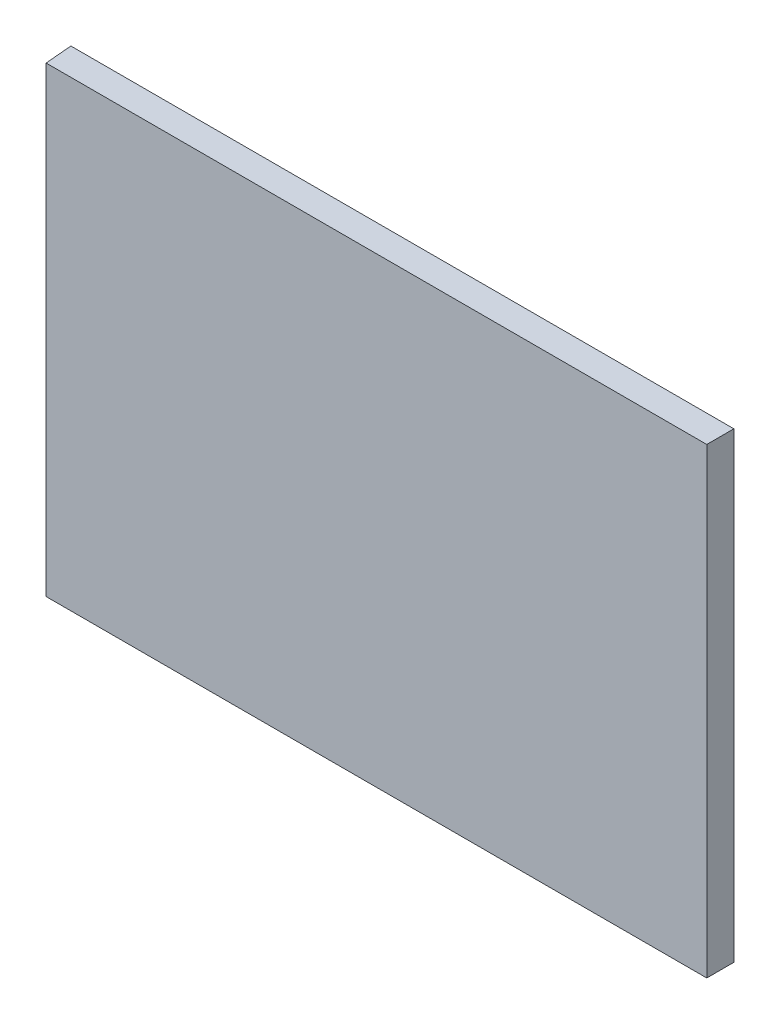
ISO-10303-21;
HEADER;
FILE_DESCRIPTION(('STEP AP214'),'2;1');
FILE_NAME('part.step','',(''),(''),'','','');
FILE_SCHEMA(('AUTOMOTIVE_DESIGN { 1 0 10303 214 1 1 1 1 }'));
ENDSEC;
DATA;
#1=APPLICATION_CONTEXT('core data for automotive mechanical design processes');
#2=APPLICATION_PROTOCOL_DEFINITION('international standard','automotive_design',2000,#1);
#3=PRODUCT_CONTEXT('',#1,'mechanical');
#4=PRODUCT('Part','Part','',(#3));
#5=PRODUCT_RELATED_PRODUCT_CATEGORY('part','',(#4));
#6=PRODUCT_DEFINITION_FORMATION('','',#4);
#7=PRODUCT_DEFINITION_CONTEXT('part definition',#1,'design');
#8=PRODUCT_DEFINITION('design','',#6,#7);
#9=PRODUCT_DEFINITION_SHAPE('','',#8);
#10=(LENGTH_UNIT() NAMED_UNIT(*) SI_UNIT(.MILLI.,.METRE.));
#11=(NAMED_UNIT(*) PLANE_ANGLE_UNIT() SI_UNIT($,.RADIAN.));
#12=(NAMED_UNIT(*) SI_UNIT($,.STERADIAN.) SOLID_ANGLE_UNIT());
#13=UNCERTAINTY_MEASURE_WITH_UNIT(LENGTH_MEASURE(1.E-05),#10,'distance_accuracy_value','');
#14=(GEOMETRIC_REPRESENTATION_CONTEXT(3) GLOBAL_UNCERTAINTY_ASSIGNED_CONTEXT((#13)) GLOBAL_UNIT_ASSIGNED_CONTEXT((#10,
#11,#12)) REPRESENTATION_CONTEXT('',''));
#15=CARTESIAN_POINT('',(0.,0.,0.));
#16=DIRECTION('',(0.,0.,1.));
#17=DIRECTION('',(1.,0.,0.));
#18=AXIS2_PLACEMENT_3D('',#15,#16,#17);
#19=CARTESIAN_POINT('',(0.,0.,1.));
#20=DIRECTION('',(0.,0.,1.));
#21=DIRECTION('',(1.,0.,0.));
#22=AXIS2_PLACEMENT_3D('',#19,#20,#21);
#23=PLANE('',#22);
#24=DIRECTION('',(-1.,0.,0.));
#25=VECTOR('',#24,1.);
#26=CARTESIAN_POINT('',(13.4118723306581,-10.04,1.));
#27=LINE('',#26,#25);
#28=CARTESIAN_POINT('',(13.4118723306581,-10.04,1.));
#29=VERTEX_POINT('',#28);
#30=CARTESIAN_POINT('',(-10.950639005816,-10.04,1.));
#31=VERTEX_POINT('',#30);
#32=EDGE_CURVE('E92',#29,#31,#27,.T.);
#33=ORIENTED_EDGE('',*,*,#32,.F.);
#34=DIRECTION('',(0.,-1.,0.));
#35=VECTOR('',#34,1.);
#36=CARTESIAN_POINT('',(13.4118723306581,7.,1.));
#37=LINE('',#36,#35);
#38=CARTESIAN_POINT('',(13.4118723306581,7.,1.));
#39=VERTEX_POINT('',#38);
#40=EDGE_CURVE('E99',#39,#29,#37,.T.);
#41=ORIENTED_EDGE('',*,*,#40,.F.);
#42=DIRECTION('',(1.,0.,0.));
#43=VECTOR('',#42,1.);
#44=CARTESIAN_POINT('',(-10.950639005816,7.,1.));
#45=LINE('',#44,#43);
#46=CARTESIAN_POINT('',(-10.950639005816,7.,1.));
#47=VERTEX_POINT('',#46);
#48=EDGE_CURVE('E88',#47,#39,#45,.T.);
#49=ORIENTED_EDGE('',*,*,#48,.F.);
#50=DIRECTION('',(0.,1.,0.));
#51=VECTOR('',#50,1.);
#52=CARTESIAN_POINT('',(-10.950639005816,-12.04,1.));
#53=LINE('',#52,#51);
#54=EDGE_CURVE('E50',#31,#47,#53,.T.);
#55=ORIENTED_EDGE('',*,*,#54,.F.);
#56=EDGE_LOOP('',(#33,#41,#49,#55));
#57=FACE_BOUND('',#56,.T.);
#58=ADVANCED_FACE('F42',(#57),#23,.T.);
#59=CARTESIAN_POINT('',(0.,0.,0.));
#60=DIRECTION('',(0.,0.,1.));
#61=DIRECTION('',(1.,0.,0.));
#62=AXIS2_PLACEMENT_3D('',#59,#60,#61);
#63=PLANE('',#62);
#64=DIRECTION('',(0.,-1.,0.));
#65=VECTOR('',#64,1.);
#66=CARTESIAN_POINT('',(-11.0381276693419,9.,0.));
#67=LINE('',#66,#65);
#68=CARTESIAN_POINT('',(-11.0381276693419,7.,0.));
#69=VERTEX_POINT('',#68);
#70=CARTESIAN_POINT('',(-11.0381276693419,-10.04,0.));
#71=VERTEX_POINT('',#70);
#72=EDGE_CURVE('E11',#69,#71,#67,.T.);
#73=ORIENTED_EDGE('',*,*,#72,.F.);
#74=DIRECTION('',(-1.,0.,0.));
#75=VECTOR('',#74,1.);
#76=CARTESIAN_POINT('',(-10.950639005816,7.,0.));
#77=LINE('',#76,#75);
#78=CARTESIAN_POINT('',(13.4118723306581,7.,0.));
#79=VERTEX_POINT('',#78);
#80=EDGE_CURVE('E103',#79,#69,#77,.T.);
#81=ORIENTED_EDGE('',*,*,#80,.F.);
#82=DIRECTION('',(0.,1.,0.));
#83=VECTOR('',#82,1.);
#84=CARTESIAN_POINT('',(13.4118723306581,7.,0.));
#85=LINE('',#84,#83);
#86=CARTESIAN_POINT('',(13.4118723306581,-10.04,0.));
#87=VERTEX_POINT('',#86);
#88=EDGE_CURVE('E64',#87,#79,#85,.T.);
#89=ORIENTED_EDGE('',*,*,#88,.F.);
#90=DIRECTION('',(1.,0.,0.));
#91=VECTOR('',#90,1.);
#92=CARTESIAN_POINT('',(13.4118723306581,-10.04,0.));
#93=LINE('',#92,#91);
#94=EDGE_CURVE('E57',#71,#87,#93,.T.);
#95=ORIENTED_EDGE('',*,*,#94,.F.);
#96=EDGE_LOOP('',(#73,#81,#89,#95));
#97=FACE_BOUND('',#96,.T.);
#98=ADVANCED_FACE('F44',(#97),#63,.F.);
#99=CARTESIAN_POINT('',(-10.950639005816,-12.04,1.));
#100=DIRECTION('',(0.996194698091746,0.,-0.0871557427476526));
#101=DIRECTION('',(-0.0871557427476526,0.,-0.996194698091746));
#102=AXIS2_PLACEMENT_3D('',#99,#100,#101);
#103=PLANE('',#102);
#104=ORIENTED_EDGE('',*,*,#54,.T.);
#105=DIRECTION('',(-0.0871557427476526,0.,-0.996194698091746));
#106=VECTOR('',#105,1.);
#107=CARTESIAN_POINT('',(-10.950639005816,7.,1.));
#108=LINE('',#107,#106);
#109=EDGE_CURVE('E89',#47,#69,#108,.T.);
#110=ORIENTED_EDGE('',*,*,#109,.T.);
#111=ORIENTED_EDGE('',*,*,#72,.T.);
#112=DIRECTION('',(0.0871557427476526,0.,0.996194698091746));
#113=VECTOR('',#112,1.);
#114=CARTESIAN_POINT('',(-10.950639005816,-10.04,1.));
#115=LINE('',#114,#113);
#116=EDGE_CURVE('E82',#71,#31,#115,.T.);
#117=ORIENTED_EDGE('',*,*,#116,.T.);
#118=EDGE_LOOP('',(#104,#110,#111,#117));
#119=FACE_BOUND('',#118,.T.);
#120=ADVANCED_FACE('F84',(#119),#103,.F.);
#121=CARTESIAN_POINT('',(13.4118723306581,-10.04,-33.3399324028896));
#122=DIRECTION('',(0.,1.,0.));
#123=DIRECTION('',(-1.,0.,0.));
#124=AXIS2_PLACEMENT_3D('',#121,#122,#123);
#125=PLANE('',#124);
#126=ORIENTED_EDGE('',*,*,#94,.T.);
#127=DIRECTION('',(0.,0.,1.));
#128=VECTOR('',#127,1.);
#129=CARTESIAN_POINT('',(13.4118723306581,-10.04,-33.3399324028896));
#130=LINE('',#129,#128);
#131=EDGE_CURVE('E94',#87,#29,#130,.T.);
#132=ORIENTED_EDGE('',*,*,#131,.T.);
#133=ORIENTED_EDGE('',*,*,#32,.T.);
#134=ORIENTED_EDGE('',*,*,#116,.F.);
#135=EDGE_LOOP('',(#126,#132,#133,#134));
#136=FACE_BOUND('',#135,.T.);
#137=ADVANCED_FACE('F93',(#136),#125,.F.);
#138=CARTESIAN_POINT('',(13.4118723306581,7.,-33.3399324028896));
#139=DIRECTION('',(-1.,0.,0.));
#140=DIRECTION('',(0.,0.,1.));
#141=AXIS2_PLACEMENT_3D('',#138,#139,#140);
#142=PLANE('',#141);
#143=ORIENTED_EDGE('',*,*,#88,.T.);
#144=DIRECTION('',(0.,0.,1.));
#145=VECTOR('',#144,1.);
#146=CARTESIAN_POINT('',(13.4118723306581,7.,-33.3399324028896));
#147=LINE('',#146,#145);
#148=EDGE_CURVE('E98',#79,#39,#147,.T.);
#149=ORIENTED_EDGE('',*,*,#148,.T.);
#150=ORIENTED_EDGE('',*,*,#40,.T.);
#151=ORIENTED_EDGE('',*,*,#131,.F.);
#152=EDGE_LOOP('',(#143,#149,#150,#151));
#153=FACE_BOUND('',#152,.T.);
#154=ADVANCED_FACE('F116',(#153),#142,.F.);
#155=CARTESIAN_POINT('',(-10.950639005816,7.,-33.3399324028896));
#156=DIRECTION('',(0.,-1.,0.));
#157=DIRECTION('',(0.,0.,-1.));
#158=AXIS2_PLACEMENT_3D('',#155,#156,#157);
#159=PLANE('',#158);
#160=ORIENTED_EDGE('',*,*,#80,.T.);
#161=ORIENTED_EDGE('',*,*,#109,.F.);
#162=ORIENTED_EDGE('',*,*,#48,.T.);
#163=ORIENTED_EDGE('',*,*,#148,.F.);
#164=EDGE_LOOP('',(#160,#161,#162,#163));
#165=FACE_BOUND('',#164,.T.);
#166=ADVANCED_FACE('F115',(#165),#159,.F.);
#167=CLOSED_SHELL('',(#58,#98,#120,#137,#154,#166));
#168=MANIFOLD_SOLID_BREP('B2',#167);
#169=ADVANCED_BREP_SHAPE_REPRESENTATION('',(#18,#168),#14);
#170=SHAPE_DEFINITION_REPRESENTATION(#9,#169);
ENDSEC;
END-ISO-10303-21;
